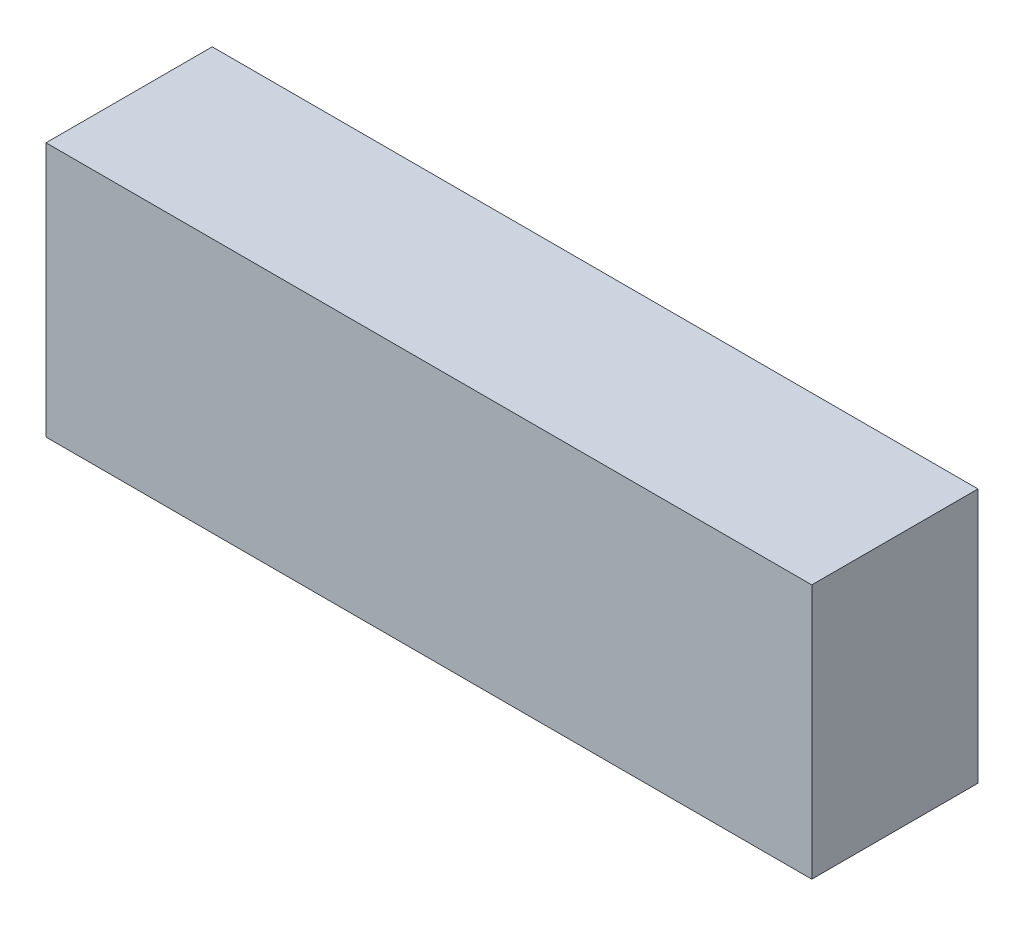
ISO-10303-21;
HEADER;
FILE_DESCRIPTION(('STEP AP214'),'2;1');
FILE_NAME('part.step','',(''),(''),'','','');
FILE_SCHEMA(('AUTOMOTIVE_DESIGN { 1 0 10303 214 1 1 1 1 }'));
ENDSEC;
DATA;
#1=APPLICATION_CONTEXT('core data for automotive mechanical design processes');
#2=APPLICATION_PROTOCOL_DEFINITION('international standard','automotive_design',2000,#1);
#3=PRODUCT_CONTEXT('',#1,'mechanical');
#4=PRODUCT('Part','Part','',(#3));
#5=PRODUCT_RELATED_PRODUCT_CATEGORY('part','',(#4));
#6=PRODUCT_DEFINITION_FORMATION('','',#4);
#7=PRODUCT_DEFINITION_CONTEXT('part definition',#1,'design');
#8=PRODUCT_DEFINITION('design','',#6,#7);
#9=PRODUCT_DEFINITION_SHAPE('','',#8);
#10=(LENGTH_UNIT() NAMED_UNIT(*) SI_UNIT(.MILLI.,.METRE.));
#11=(NAMED_UNIT(*) PLANE_ANGLE_UNIT() SI_UNIT($,.RADIAN.));
#12=(NAMED_UNIT(*) SI_UNIT($,.STERADIAN.) SOLID_ANGLE_UNIT());
#13=UNCERTAINTY_MEASURE_WITH_UNIT(LENGTH_MEASURE(1.E-05),#10,'distance_accuracy_value','');
#14=(GEOMETRIC_REPRESENTATION_CONTEXT(3) GLOBAL_UNCERTAINTY_ASSIGNED_CONTEXT((#13)) GLOBAL_UNIT_ASSIGNED_CONTEXT((#10,
#11,#12)) REPRESENTATION_CONTEXT('',''));
#15=CARTESIAN_POINT('',(0.,0.,0.));
#16=DIRECTION('',(0.,0.,1.));
#17=DIRECTION('',(1.,0.,0.));
#18=AXIS2_PLACEMENT_3D('',#15,#16,#17);
#19=CARTESIAN_POINT('',(43.8785,14.605,19.05));
#20=DIRECTION('',(-1.,0.,0.));
#21=DIRECTION('',(0.,-1.,0.));
#22=AXIS2_PLACEMENT_3D('',#19,#20,#21);
#23=PLANE('',#22);
#24=DIRECTION('',(0.,1.,0.));
#25=VECTOR('',#24,1.);
#26=CARTESIAN_POINT('',(43.8785,14.605,0.));
#27=LINE('',#26,#25);
#28=CARTESIAN_POINT('',(43.8785,-14.605,0.));
#29=VERTEX_POINT('',#28);
#30=CARTESIAN_POINT('',(43.8785,14.605,0.));
#31=VERTEX_POINT('',#30);
#32=EDGE_CURVE('E106',#29,#31,#27,.T.);
#33=ORIENTED_EDGE('',*,*,#32,.T.);
#34=DIRECTION('',(0.,0.,-1.));
#35=VECTOR('',#34,1.);
#36=CARTESIAN_POINT('',(43.8785,14.605,19.05));
#37=LINE('',#36,#35);
#38=CARTESIAN_POINT('',(43.8785,14.605,19.05));
#39=VERTEX_POINT('',#38);
#40=EDGE_CURVE('E11',#39,#31,#37,.T.);
#41=ORIENTED_EDGE('',*,*,#40,.F.);
#42=DIRECTION('',(0.,1.,0.));
#43=VECTOR('',#42,1.);
#44=CARTESIAN_POINT('',(43.8785,14.605,19.05));
#45=LINE('',#44,#43);
#46=CARTESIAN_POINT('',(43.8785,-14.605,19.05));
#47=VERTEX_POINT('',#46);
#48=EDGE_CURVE('E94',#47,#39,#45,.T.);
#49=ORIENTED_EDGE('',*,*,#48,.F.);
#50=DIRECTION('',(0.,0.,-1.));
#51=VECTOR('',#50,1.);
#52=CARTESIAN_POINT('',(43.8785,-14.605,19.05));
#53=LINE('',#52,#51);
#54=EDGE_CURVE('E102',#47,#29,#53,.T.);
#55=ORIENTED_EDGE('',*,*,#54,.T.);
#56=EDGE_LOOP('',(#33,#41,#49,#55));
#57=FACE_BOUND('',#56,.T.);
#58=ADVANCED_FACE('F43',(#57),#23,.F.);
#59=CARTESIAN_POINT('',(-43.8785,14.605,19.05));
#60=DIRECTION('',(0.,-1.,0.));
#61=DIRECTION('',(0.,0.,-1.));
#62=AXIS2_PLACEMENT_3D('',#59,#60,#61);
#63=PLANE('',#62);
#64=DIRECTION('',(-1.,0.,0.));
#65=VECTOR('',#64,1.);
#66=CARTESIAN_POINT('',(-43.8785,14.605,0.));
#67=LINE('',#66,#65);
#68=CARTESIAN_POINT('',(-43.8785,14.605,0.));
#69=VERTEX_POINT('',#68);
#70=EDGE_CURVE('E98',#31,#69,#67,.T.);
#71=ORIENTED_EDGE('',*,*,#70,.T.);
#72=DIRECTION('',(0.,0.,-1.));
#73=VECTOR('',#72,1.);
#74=CARTESIAN_POINT('',(-43.8785,14.605,19.05));
#75=LINE('',#74,#73);
#76=CARTESIAN_POINT('',(-43.8785,14.605,19.05));
#77=VERTEX_POINT('',#76);
#78=EDGE_CURVE('E51',#77,#69,#75,.T.);
#79=ORIENTED_EDGE('',*,*,#78,.F.);
#80=DIRECTION('',(-1.,0.,0.));
#81=VECTOR('',#80,1.);
#82=CARTESIAN_POINT('',(-43.8785,14.605,19.05));
#83=LINE('',#82,#81);
#84=EDGE_CURVE('E89',#39,#77,#83,.T.);
#85=ORIENTED_EDGE('',*,*,#84,.F.);
#86=ORIENTED_EDGE('',*,*,#40,.T.);
#87=EDGE_LOOP('',(#71,#79,#85,#86));
#88=FACE_BOUND('',#87,.T.);
#89=ADVANCED_FACE('F97',(#88),#63,.F.);
#90=CARTESIAN_POINT('',(-43.8785,14.605,19.05));
#91=DIRECTION('',(1.,0.,0.));
#92=DIRECTION('',(0.,1.,0.));
#93=AXIS2_PLACEMENT_3D('',#90,#91,#92);
#94=PLANE('',#93);
#95=DIRECTION('',(0.,-1.,0.));
#96=VECTOR('',#95,1.);
#97=CARTESIAN_POINT('',(-43.8785,14.605,0.));
#98=LINE('',#97,#96);
#99=CARTESIAN_POINT('',(-43.8785,-14.605,0.));
#100=VERTEX_POINT('',#99);
#101=EDGE_CURVE('E76',#69,#100,#98,.T.);
#102=ORIENTED_EDGE('',*,*,#101,.T.);
#103=DIRECTION('',(0.,0.,-1.));
#104=VECTOR('',#103,1.);
#105=CARTESIAN_POINT('',(-43.8785,-14.605,19.05));
#106=LINE('',#105,#104);
#107=CARTESIAN_POINT('',(-43.8785,-14.605,19.05));
#108=VERTEX_POINT('',#107);
#109=EDGE_CURVE('E99',#108,#100,#106,.T.);
#110=ORIENTED_EDGE('',*,*,#109,.F.);
#111=DIRECTION('',(0.,-1.,0.));
#112=VECTOR('',#111,1.);
#113=CARTESIAN_POINT('',(-43.8785,14.605,19.05));
#114=LINE('',#113,#112);
#115=EDGE_CURVE('E92',#77,#108,#114,.T.);
#116=ORIENTED_EDGE('',*,*,#115,.F.);
#117=ORIENTED_EDGE('',*,*,#78,.T.);
#118=EDGE_LOOP('',(#102,#110,#116,#117));
#119=FACE_BOUND('',#118,.T.);
#120=ADVANCED_FACE('F100',(#119),#94,.F.);
#121=CARTESIAN_POINT('',(-43.8785,-14.605,19.05));
#122=DIRECTION('',(0.,1.,0.));
#123=DIRECTION('',(0.,0.,1.));
#124=AXIS2_PLACEMENT_3D('',#121,#122,#123);
#125=PLANE('',#124);
#126=DIRECTION('',(1.,0.,0.));
#127=VECTOR('',#126,1.);
#128=CARTESIAN_POINT('',(-43.8785,-14.605,0.));
#129=LINE('',#128,#127);
#130=EDGE_CURVE('E82',#100,#29,#129,.T.);
#131=ORIENTED_EDGE('',*,*,#130,.T.);
#132=ORIENTED_EDGE('',*,*,#54,.F.);
#133=DIRECTION('',(1.,0.,0.));
#134=VECTOR('',#133,1.);
#135=CARTESIAN_POINT('',(-43.8785,-14.605,19.05));
#136=LINE('',#135,#134);
#137=EDGE_CURVE('E59',#108,#47,#136,.T.);
#138=ORIENTED_EDGE('',*,*,#137,.F.);
#139=ORIENTED_EDGE('',*,*,#109,.T.);
#140=EDGE_LOOP('',(#131,#132,#138,#139));
#141=FACE_BOUND('',#140,.T.);
#142=ADVANCED_FACE('F113',(#141),#125,.F.);
#143=CARTESIAN_POINT('',(0.,0.,19.05));
#144=DIRECTION('',(0.,0.,1.));
#145=DIRECTION('',(1.,0.,0.));
#146=AXIS2_PLACEMENT_3D('',#143,#144,#145);
#147=PLANE('',#146);
#148=ORIENTED_EDGE('',*,*,#48,.T.);
#149=ORIENTED_EDGE('',*,*,#84,.T.);
#150=ORIENTED_EDGE('',*,*,#115,.T.);
#151=ORIENTED_EDGE('',*,*,#137,.T.);
#152=EDGE_LOOP('',(#148,#149,#150,#151));
#153=FACE_BOUND('',#152,.T.);
#154=ADVANCED_FACE('F90',(#153),#147,.T.);
#155=CARTESIAN_POINT('',(0.,0.,0.));
#156=DIRECTION('',(0.,0.,1.));
#157=DIRECTION('',(1.,0.,0.));
#158=AXIS2_PLACEMENT_3D('',#155,#156,#157);
#159=PLANE('',#158);
#160=ORIENTED_EDGE('',*,*,#32,.F.);
#161=ORIENTED_EDGE('',*,*,#130,.F.);
#162=ORIENTED_EDGE('',*,*,#101,.F.);
#163=ORIENTED_EDGE('',*,*,#70,.F.);
#164=EDGE_LOOP('',(#160,#161,#162,#163));
#165=FACE_BOUND('',#164,.T.);
#166=ADVANCED_FACE('F116',(#165),#159,.F.);
#167=CLOSED_SHELL('',(#58,#89,#120,#142,#154,#166));
#168=MANIFOLD_SOLID_BREP('B2',#167);
#169=ADVANCED_BREP_SHAPE_REPRESENTATION('',(#18,#168),#14);
#170=SHAPE_DEFINITION_REPRESENTATION(#9,#169);
ENDSEC;
END-ISO-10303-21;
